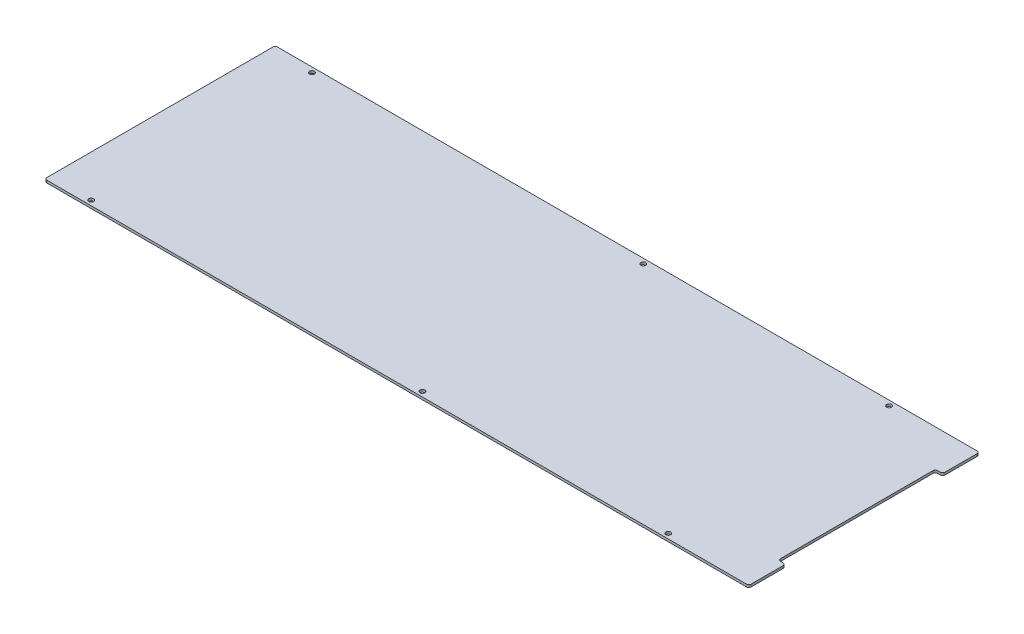
ISO-10303-21;
HEADER;
FILE_DESCRIPTION(('STEP AP214'),'2;1');
FILE_NAME('part.step','',(''),(''),'','','');
FILE_SCHEMA(('AUTOMOTIVE_DESIGN { 1 0 10303 214 1 1 1 1 }'));
ENDSEC;
DATA;
#1=APPLICATION_CONTEXT('core data for automotive mechanical design processes');
#2=APPLICATION_PROTOCOL_DEFINITION('international standard','automotive_design',2000,#1);
#3=PRODUCT_CONTEXT('',#1,'mechanical');
#4=PRODUCT('Part','Part','',(#3));
#5=PRODUCT_RELATED_PRODUCT_CATEGORY('part','',(#4));
#6=PRODUCT_DEFINITION_FORMATION('','',#4);
#7=PRODUCT_DEFINITION_CONTEXT('part definition',#1,'design');
#8=PRODUCT_DEFINITION('design','',#6,#7);
#9=PRODUCT_DEFINITION_SHAPE('','',#8);
#10=(LENGTH_UNIT() NAMED_UNIT(*) SI_UNIT(.MILLI.,.METRE.));
#11=(NAMED_UNIT(*) PLANE_ANGLE_UNIT() SI_UNIT($,.RADIAN.));
#12=(NAMED_UNIT(*) SI_UNIT($,.STERADIAN.) SOLID_ANGLE_UNIT());
#13=UNCERTAINTY_MEASURE_WITH_UNIT(LENGTH_MEASURE(1.E-05),#10,'distance_accuracy_value','');
#14=(GEOMETRIC_REPRESENTATION_CONTEXT(3) GLOBAL_UNCERTAINTY_ASSIGNED_CONTEXT((#13)) GLOBAL_UNIT_ASSIGNED_CONTEXT((#10,
#11,#12)) REPRESENTATION_CONTEXT('',''));
#15=CARTESIAN_POINT('',(0.,0.,0.));
#16=DIRECTION('',(0.,0.,1.));
#17=DIRECTION('',(1.,0.,0.));
#18=AXIS2_PLACEMENT_3D('',#15,#16,#17);
#19=CARTESIAN_POINT('',(455.6125,3.175,149.225));
#20=DIRECTION('',(-1.,0.,0.));
#21=DIRECTION('',(0.,0.,1.));
#22=AXIS2_PLACEMENT_3D('',#19,#20,#21);
#23=PLANE('',#22);
#24=DIRECTION('',(0.,0.,-1.));
#25=VECTOR('',#24,1.);
#26=CARTESIAN_POINT('',(455.6125,3.175,149.225));
#27=LINE('',#26,#25);
#28=CARTESIAN_POINT('',(455.6125,3.175,146.05));
#29=VERTEX_POINT('',#28);
#30=CARTESIAN_POINT('',(455.6125,3.175,104.775));
#31=VERTEX_POINT('',#30);
#32=EDGE_CURVE('E233',#29,#31,#27,.T.);
#33=ORIENTED_EDGE('',*,*,#32,.F.);
#34=DIRECTION('',(0.,-1.,0.));
#35=VECTOR('',#34,1.);
#36=CARTESIAN_POINT('',(455.6125,3.175,146.05));
#37=LINE('',#36,#35);
#38=CARTESIAN_POINT('',(455.6125,0.,146.05));
#39=VERTEX_POINT('',#38);
#40=EDGE_CURVE('E333',#29,#39,#37,.T.);
#41=ORIENTED_EDGE('',*,*,#40,.T.);
#42=DIRECTION('',(0.,0.,-1.));
#43=VECTOR('',#42,1.);
#44=CARTESIAN_POINT('',(455.6125,0.,149.225));
#45=LINE('',#44,#43);
#46=CARTESIAN_POINT('',(455.6125,0.,104.775));
#47=VERTEX_POINT('',#46);
#48=EDGE_CURVE('E248',#39,#47,#45,.T.);
#49=ORIENTED_EDGE('',*,*,#48,.T.);
#50=DIRECTION('',(0.,1.,0.));
#51=VECTOR('',#50,1.);
#52=CARTESIAN_POINT('',(455.6125,3.175,104.775));
#53=LINE('',#52,#51);
#54=EDGE_CURVE('E329',#47,#31,#53,.T.);
#55=ORIENTED_EDGE('',*,*,#54,.T.);
#56=EDGE_LOOP('',(#33,#41,#49,#55));
#57=FACE_BOUND('',#56,.T.);
#58=ADVANCED_FACE('F60',(#57),#23,.F.);
#59=CARTESIAN_POINT('',(455.6125,3.175,-104.775));
#60=VERTEX_POINT('',#59);
#61=CARTESIAN_POINT('',(455.6125,3.175,-146.05));
#62=VERTEX_POINT('',#61);
#63=EDGE_CURVE('E230',#60,#62,#27,.T.);
#64=ORIENTED_EDGE('',*,*,#63,.F.);
#65=DIRECTION('',(0.,1.,0.));
#66=VECTOR('',#65,1.);
#67=CARTESIAN_POINT('',(455.6125,3.175,-104.775));
#68=LINE('',#67,#66);
#69=CARTESIAN_POINT('',(455.6125,0.,-104.775));
#70=VERTEX_POINT('',#69);
#71=EDGE_CURVE('E12',#60,#70,#68,.F.);
#72=ORIENTED_EDGE('',*,*,#71,.T.);
#73=CARTESIAN_POINT('',(455.6125,0.,-146.05));
#74=VERTEX_POINT('',#73);
#75=EDGE_CURVE('E244',#70,#74,#45,.T.);
#76=ORIENTED_EDGE('',*,*,#75,.T.);
#77=DIRECTION('',(0.,-1.,0.));
#78=VECTOR('',#77,1.);
#79=CARTESIAN_POINT('',(455.6125,3.175,-146.05));
#80=LINE('',#79,#78);
#81=EDGE_CURVE('E69',#74,#62,#80,.F.);
#82=ORIENTED_EDGE('',*,*,#81,.T.);
#83=EDGE_LOOP('',(#64,#72,#76,#82));
#84=FACE_BOUND('',#83,.T.);
#85=ADVANCED_FACE('F348',(#84),#23,.F.);
#86=CARTESIAN_POINT('',(-455.6125,3.175,-149.225));
#87=DIRECTION('',(0.,0.,1.));
#88=DIRECTION('',(1.,0.,0.));
#89=AXIS2_PLACEMENT_3D('',#86,#87,#88);
#90=PLANE('',#89);
#91=DIRECTION('',(-1.,0.,0.));
#92=VECTOR('',#91,1.);
#93=CARTESIAN_POINT('',(-455.6125,0.,-149.225));
#94=LINE('',#93,#92);
#95=CARTESIAN_POINT('',(452.4375,0.,-149.225));
#96=VERTEX_POINT('',#95);
#97=CARTESIAN_POINT('',(-452.4375,0.,-149.225));
#98=VERTEX_POINT('',#97);
#99=EDGE_CURVE('E249',#96,#98,#94,.T.);
#100=ORIENTED_EDGE('',*,*,#99,.T.);
#101=DIRECTION('',(0.,-1.,0.));
#102=VECTOR('',#101,1.);
#103=CARTESIAN_POINT('',(-452.4375,3.175,-149.225));
#104=LINE('',#103,#102);
#105=CARTESIAN_POINT('',(-452.4375,3.175,-149.225));
#106=VERTEX_POINT('',#105);
#107=EDGE_CURVE('E76',#98,#106,#104,.F.);
#108=ORIENTED_EDGE('',*,*,#107,.T.);
#109=DIRECTION('',(-1.,0.,0.));
#110=VECTOR('',#109,1.);
#111=CARTESIAN_POINT('',(-455.6125,3.175,-149.225));
#112=LINE('',#111,#110);
#113=CARTESIAN_POINT('',(452.4375,3.175,-149.225));
#114=VERTEX_POINT('',#113);
#115=EDGE_CURVE('E235',#114,#106,#112,.T.);
#116=ORIENTED_EDGE('',*,*,#115,.F.);
#117=DIRECTION('',(0.,-1.,0.));
#118=VECTOR('',#117,1.);
#119=CARTESIAN_POINT('',(452.4375,3.175,-149.225));
#120=LINE('',#119,#118);
#121=EDGE_CURVE('E323',#114,#96,#120,.T.);
#122=ORIENTED_EDGE('',*,*,#121,.T.);
#123=EDGE_LOOP('',(#100,#108,#116,#122));
#124=FACE_BOUND('',#123,.T.);
#125=ADVANCED_FACE('F355',(#124),#90,.F.);
#126=CARTESIAN_POINT('',(-455.6125,3.175,149.225));
#127=DIRECTION('',(1.,0.,0.));
#128=DIRECTION('',(0.,0.,-1.));
#129=AXIS2_PLACEMENT_3D('',#126,#127,#128);
#130=PLANE('',#129);
#131=DIRECTION('',(0.,0.,1.));
#132=VECTOR('',#131,1.);
#133=CARTESIAN_POINT('',(-455.6125,0.,149.225));
#134=LINE('',#133,#132);
#135=CARTESIAN_POINT('',(-455.6125,0.,-146.05));
#136=VERTEX_POINT('',#135);
#137=CARTESIAN_POINT('',(-455.6125,0.,146.05));
#138=VERTEX_POINT('',#137);
#139=EDGE_CURVE('E252',#136,#138,#134,.T.);
#140=ORIENTED_EDGE('',*,*,#139,.T.);
#141=DIRECTION('',(0.,-1.,0.));
#142=VECTOR('',#141,1.);
#143=CARTESIAN_POINT('',(-455.6125,3.175,146.05));
#144=LINE('',#143,#142);
#145=CARTESIAN_POINT('',(-455.6125,3.175,146.05));
#146=VERTEX_POINT('',#145);
#147=EDGE_CURVE('E304',#138,#146,#144,.F.);
#148=ORIENTED_EDGE('',*,*,#147,.T.);
#149=DIRECTION('',(0.,0.,1.));
#150=VECTOR('',#149,1.);
#151=CARTESIAN_POINT('',(-455.6125,3.175,149.225));
#152=LINE('',#151,#150);
#153=CARTESIAN_POINT('',(-455.6125,3.175,-146.05));
#154=VERTEX_POINT('',#153);
#155=EDGE_CURVE('E238',#154,#146,#152,.T.);
#156=ORIENTED_EDGE('',*,*,#155,.F.);
#157=DIRECTION('',(0.,-1.,0.));
#158=VECTOR('',#157,1.);
#159=CARTESIAN_POINT('',(-455.6125,3.175,-146.05));
#160=LINE('',#159,#158);
#161=EDGE_CURVE('E300',#154,#136,#160,.T.);
#162=ORIENTED_EDGE('',*,*,#161,.T.);
#163=EDGE_LOOP('',(#140,#148,#156,#162));
#164=FACE_BOUND('',#163,.T.);
#165=ADVANCED_FACE('F366',(#164),#130,.F.);
#166=CARTESIAN_POINT('',(-455.6125,3.175,149.225));
#167=DIRECTION('',(0.,0.,-1.));
#168=DIRECTION('',(-1.,0.,0.));
#169=AXIS2_PLACEMENT_3D('',#166,#167,#168);
#170=PLANE('',#169);
#171=DIRECTION('',(1.,0.,0.));
#172=VECTOR('',#171,1.);
#173=CARTESIAN_POINT('',(-455.6125,3.175,149.225));
#174=LINE('',#173,#172);
#175=CARTESIAN_POINT('',(-452.4375,3.175,149.225));
#176=VERTEX_POINT('',#175);
#177=CARTESIAN_POINT('',(452.4375,3.175,149.225));
#178=VERTEX_POINT('',#177);
#179=EDGE_CURVE('E210',#176,#178,#174,.T.);
#180=ORIENTED_EDGE('',*,*,#179,.F.);
#181=DIRECTION('',(0.,-1.,0.));
#182=VECTOR('',#181,1.);
#183=CARTESIAN_POINT('',(-452.4375,3.175,149.225));
#184=LINE('',#183,#182);
#185=CARTESIAN_POINT('',(-452.4375,0.,149.225));
#186=VERTEX_POINT('',#185);
#187=EDGE_CURVE('E278',#176,#186,#184,.T.);
#188=ORIENTED_EDGE('',*,*,#187,.T.);
#189=DIRECTION('',(1.,0.,0.));
#190=VECTOR('',#189,1.);
#191=CARTESIAN_POINT('',(-455.6125,0.,149.225));
#192=LINE('',#191,#190);
#193=CARTESIAN_POINT('',(452.4375,0.,149.225));
#194=VERTEX_POINT('',#193);
#195=EDGE_CURVE('E234',#186,#194,#192,.T.);
#196=ORIENTED_EDGE('',*,*,#195,.T.);
#197=DIRECTION('',(0.,-1.,0.));
#198=VECTOR('',#197,1.);
#199=CARTESIAN_POINT('',(452.4375,3.175,149.225));
#200=LINE('',#199,#198);
#201=EDGE_CURVE('E275',#194,#178,#200,.F.);
#202=ORIENTED_EDGE('',*,*,#201,.T.);
#203=EDGE_LOOP('',(#180,#188,#196,#202));
#204=FACE_BOUND('',#203,.T.);
#205=ADVANCED_FACE('F374',(#204),#170,.F.);
#206=CARTESIAN_POINT('',(0.,3.175,0.));
#207=DIRECTION('',(0.,-1.,0.));
#208=DIRECTION('',(0.,0.,-1.));
#209=AXIS2_PLACEMENT_3D('',#206,#207,#208);
#210=PLANE('',#209);
#211=CARTESIAN_POINT('',(345.04884,3.175,142.875));
#212=DIRECTION('',(0.,-1.,0.));
#213=DIRECTION('',(0.,0.,-1.));
#214=AXIS2_PLACEMENT_3D('',#211,#212,#213);
#215=CIRCLE('',#214,3.17499999999998);
#216=CARTESIAN_POINT('',(345.04884,3.175,139.7));
#217=VERTEX_POINT('',#216);
#218=EDGE_CURVE('E403',#217,#217,#215,.T.);
#219=ORIENTED_EDGE('',*,*,#218,.T.);
#220=EDGE_LOOP('',(#219));
#221=FACE_BOUND('',#220,.T.);
#222=CARTESIAN_POINT('',(-401.6375,3.175,142.875));
#223=DIRECTION('',(0.,-1.,0.));
#224=DIRECTION('',(0.,0.,-1.));
#225=AXIS2_PLACEMENT_3D('',#222,#223,#224);
#226=CIRCLE('',#225,3.17499999999998);
#227=CARTESIAN_POINT('',(-401.6375,3.175,139.7));
#228=VERTEX_POINT('',#227);
#229=EDGE_CURVE('E423',#228,#228,#226,.T.);
#230=ORIENTED_EDGE('',*,*,#229,.T.);
#231=EDGE_LOOP('',(#230));
#232=FACE_BOUND('',#231,.T.);
#233=CARTESIAN_POINT('',(26.9875000000001,3.175,142.875));
#234=DIRECTION('',(0.,-1.,0.));
#235=DIRECTION('',(0.,0.,-1.));
#236=AXIS2_PLACEMENT_3D('',#233,#234,#235);
#237=CIRCLE('',#236,3.175);
#238=CARTESIAN_POINT('',(26.9875000000001,3.175,139.7));
#239=VERTEX_POINT('',#238);
#240=EDGE_CURVE('E422',#239,#239,#237,.T.);
#241=ORIENTED_EDGE('',*,*,#240,.T.);
#242=EDGE_LOOP('',(#241));
#243=FACE_BOUND('',#242,.T.);
#244=CARTESIAN_POINT('',(345.04884,3.175,-142.875));
#245=DIRECTION('',(0.,-1.,0.));
#246=DIRECTION('',(0.,0.,-1.));
#247=AXIS2_PLACEMENT_3D('',#244,#245,#246);
#248=CIRCLE('',#247,3.17499999999998);
#249=CARTESIAN_POINT('',(345.04884,3.175,-146.05));
#250=VERTEX_POINT('',#249);
#251=EDGE_CURVE('E436',#250,#250,#248,.T.);
#252=ORIENTED_EDGE('',*,*,#251,.T.);
#253=EDGE_LOOP('',(#252));
#254=FACE_BOUND('',#253,.T.);
#255=CARTESIAN_POINT('',(-401.6375,3.175,-142.875));
#256=DIRECTION('',(0.,-1.,0.));
#257=DIRECTION('',(0.,0.,-1.));
#258=AXIS2_PLACEMENT_3D('',#255,#256,#257);
#259=CIRCLE('',#258,3.17499999999998);
#260=CARTESIAN_POINT('',(-401.6375,3.175,-146.05));
#261=VERTEX_POINT('',#260);
#262=EDGE_CURVE('E446',#261,#261,#259,.T.);
#263=ORIENTED_EDGE('',*,*,#262,.T.);
#264=EDGE_LOOP('',(#263));
#265=FACE_BOUND('',#264,.T.);
#266=CARTESIAN_POINT('',(26.9875000000001,3.175,-142.875));
#267=DIRECTION('',(0.,-1.,0.));
#268=DIRECTION('',(0.,0.,-1.));
#269=AXIS2_PLACEMENT_3D('',#266,#267,#268);
#270=CIRCLE('',#269,3.175);
#271=CARTESIAN_POINT('',(26.9875000000001,3.175,-146.05));
#272=VERTEX_POINT('',#271);
#273=EDGE_CURVE('E456',#272,#272,#270,.T.);
#274=ORIENTED_EDGE('',*,*,#273,.T.);
#275=EDGE_LOOP('',(#274));
#276=FACE_BOUND('',#275,.T.);
#277=ORIENTED_EDGE('',*,*,#155,.T.);
#278=CARTESIAN_POINT('',(-452.4375,3.175,146.05));
#279=DIRECTION('',(0.,-1.,0.));
#280=DIRECTION('',(0.,0.,-1.));
#281=AXIS2_PLACEMENT_3D('',#278,#279,#280);
#282=CIRCLE('',#281,3.175);
#283=EDGE_CURVE('E320',#146,#176,#282,.F.);
#284=ORIENTED_EDGE('',*,*,#283,.T.);
#285=ORIENTED_EDGE('',*,*,#179,.T.);
#286=CARTESIAN_POINT('',(452.4375,3.175,146.05));
#287=DIRECTION('',(0.,-1.,0.));
#288=DIRECTION('',(0.,0.,-1.));
#289=AXIS2_PLACEMENT_3D('',#286,#287,#288);
#290=CIRCLE('',#289,3.175);
#291=EDGE_CURVE('E314',#178,#29,#290,.F.);
#292=ORIENTED_EDGE('',*,*,#291,.T.);
#293=ORIENTED_EDGE('',*,*,#32,.T.);
#294=CARTESIAN_POINT('',(452.4375,3.175,104.775));
#295=DIRECTION('',(0.,-1.,0.));
#296=DIRECTION('',(0.,0.,-1.));
#297=AXIS2_PLACEMENT_3D('',#294,#295,#296);
#298=CIRCLE('',#297,3.175);
#299=CARTESIAN_POINT('',(452.4375,3.175,101.6));
#300=VERTEX_POINT('',#299);
#301=EDGE_CURVE('E215',#31,#300,#298,.F.);
#302=ORIENTED_EDGE('',*,*,#301,.T.);
#303=DIRECTION('',(1.,0.,0.));
#304=VECTOR('',#303,1.);
#305=CARTESIAN_POINT('',(455.6125,3.175,101.6));
#306=LINE('',#305,#304);
#307=CARTESIAN_POINT('',(449.2625,3.175,101.6));
#308=VERTEX_POINT('',#307);
#309=EDGE_CURVE('E204',#308,#300,#306,.T.);
#310=ORIENTED_EDGE('',*,*,#309,.F.);
#311=CARTESIAN_POINT('',(449.2625,3.175,98.425));
#312=DIRECTION('',(0.,-1.,0.));
#313=DIRECTION('',(0.,0.,-1.));
#314=AXIS2_PLACEMENT_3D('',#311,#312,#313);
#315=CIRCLE('',#314,3.175);
#316=CARTESIAN_POINT('',(446.0875,3.175,98.425));
#317=VERTEX_POINT('',#316);
#318=EDGE_CURVE('E187',#308,#317,#315,.T.);
#319=ORIENTED_EDGE('',*,*,#318,.T.);
#320=DIRECTION('',(0.,0.,1.));
#321=VECTOR('',#320,1.);
#322=CARTESIAN_POINT('',(446.0875,3.175,-101.6));
#323=LINE('',#322,#321);
#324=CARTESIAN_POINT('',(446.0875,3.175,-98.425));
#325=VERTEX_POINT('',#324);
#326=EDGE_CURVE('E218',#325,#317,#323,.T.);
#327=ORIENTED_EDGE('',*,*,#326,.F.);
#328=CARTESIAN_POINT('',(449.2625,3.175,-98.425));
#329=DIRECTION('',(0.,-1.,0.));
#330=DIRECTION('',(0.,0.,-1.));
#331=AXIS2_PLACEMENT_3D('',#328,#329,#330);
#332=CIRCLE('',#331,3.175);
#333=CARTESIAN_POINT('',(449.2625,3.175,-101.6));
#334=VERTEX_POINT('',#333);
#335=EDGE_CURVE('E268',#325,#334,#332,.T.);
#336=ORIENTED_EDGE('',*,*,#335,.T.);
#337=DIRECTION('',(-1.,0.,0.));
#338=VECTOR('',#337,1.);
#339=CARTESIAN_POINT('',(455.6125,3.175,-101.6));
#340=LINE('',#339,#338);
#341=CARTESIAN_POINT('',(452.4375,3.175,-101.6));
#342=VERTEX_POINT('',#341);
#343=EDGE_CURVE('E226',#342,#334,#340,.T.);
#344=ORIENTED_EDGE('',*,*,#343,.F.);
#345=CARTESIAN_POINT('',(452.4375,3.175,-104.775));
#346=DIRECTION('',(0.,-1.,0.));
#347=DIRECTION('',(0.,0.,-1.));
#348=AXIS2_PLACEMENT_3D('',#345,#346,#347);
#349=CIRCLE('',#348,3.175);
#350=EDGE_CURVE('E309',#342,#60,#349,.F.);
#351=ORIENTED_EDGE('',*,*,#350,.T.);
#352=ORIENTED_EDGE('',*,*,#63,.T.);
#353=CARTESIAN_POINT('',(452.4375,3.175,-146.05));
#354=DIRECTION('',(0.,-1.,0.));
#355=DIRECTION('',(0.,0.,-1.));
#356=AXIS2_PLACEMENT_3D('',#353,#354,#355);
#357=CIRCLE('',#356,3.175);
#358=EDGE_CURVE('E83',#62,#114,#357,.F.);
#359=ORIENTED_EDGE('',*,*,#358,.T.);
#360=ORIENTED_EDGE('',*,*,#115,.T.);
#361=CARTESIAN_POINT('',(-452.4375,3.175,-146.05));
#362=DIRECTION('',(0.,-1.,0.));
#363=DIRECTION('',(0.,0.,-1.));
#364=AXIS2_PLACEMENT_3D('',#361,#362,#363);
#365=CIRCLE('',#364,3.175);
#366=EDGE_CURVE('E317',#106,#154,#365,.F.);
#367=ORIENTED_EDGE('',*,*,#366,.T.);
#368=EDGE_LOOP('',(#277,#284,#285,#292,#293,#302,#310,#319,#327,#336,#344,#351,#352,#359,#360,#367));
#369=FACE_BOUND('',#368,.T.);
#370=ADVANCED_FACE('F213',(#221,#232,#243,#254,#265,#276,#369),#210,.F.);
#371=CARTESIAN_POINT('',(0.,0.,0.));
#372=DIRECTION('',(0.,-1.,0.));
#373=DIRECTION('',(0.,0.,-1.));
#374=AXIS2_PLACEMENT_3D('',#371,#372,#373);
#375=PLANE('',#374);
#376=CARTESIAN_POINT('',(345.04884,0.,142.875));
#377=DIRECTION('',(0.,-1.,0.));
#378=DIRECTION('',(0.,0.,-1.));
#379=AXIS2_PLACEMENT_3D('',#376,#377,#378);
#380=CIRCLE('',#379,3.17499999999998);
#381=CARTESIAN_POINT('',(345.04884,0.,139.7));
#382=VERTEX_POINT('',#381);
#383=EDGE_CURVE('E399',#382,#382,#380,.T.);
#384=ORIENTED_EDGE('',*,*,#383,.F.);
#385=EDGE_LOOP('',(#384));
#386=FACE_BOUND('',#385,.T.);
#387=CARTESIAN_POINT('',(-401.6375,0.,142.875));
#388=DIRECTION('',(0.,-1.,0.));
#389=DIRECTION('',(0.,0.,-1.));
#390=AXIS2_PLACEMENT_3D('',#387,#388,#389);
#391=CIRCLE('',#390,3.17499999999998);
#392=CARTESIAN_POINT('',(-401.6375,0.,139.7));
#393=VERTEX_POINT('',#392);
#394=EDGE_CURVE('E408',#393,#393,#391,.T.);
#395=ORIENTED_EDGE('',*,*,#394,.F.);
#396=EDGE_LOOP('',(#395));
#397=FACE_BOUND('',#396,.T.);
#398=CARTESIAN_POINT('',(26.9875000000001,0.,142.875));
#399=DIRECTION('',(0.,-1.,0.));
#400=DIRECTION('',(0.,0.,-1.));
#401=AXIS2_PLACEMENT_3D('',#398,#399,#400);
#402=CIRCLE('',#401,3.17499999999999);
#403=CARTESIAN_POINT('',(26.9875000000001,0.,139.7));
#404=VERTEX_POINT('',#403);
#405=EDGE_CURVE('E418',#404,#404,#402,.T.);
#406=ORIENTED_EDGE('',*,*,#405,.F.);
#407=EDGE_LOOP('',(#406));
#408=FACE_BOUND('',#407,.T.);
#409=CARTESIAN_POINT('',(345.04884,0.,-142.875));
#410=DIRECTION('',(0.,-1.,0.));
#411=DIRECTION('',(0.,0.,-1.));
#412=AXIS2_PLACEMENT_3D('',#409,#410,#411);
#413=CIRCLE('',#412,3.17499999999998);
#414=CARTESIAN_POINT('',(345.04884,0.,-146.05));
#415=VERTEX_POINT('',#414);
#416=EDGE_CURVE('E429',#415,#415,#413,.T.);
#417=ORIENTED_EDGE('',*,*,#416,.F.);
#418=EDGE_LOOP('',(#417));
#419=FACE_BOUND('',#418,.T.);
#420=CARTESIAN_POINT('',(-401.6375,0.,-142.875));
#421=DIRECTION('',(0.,-1.,0.));
#422=DIRECTION('',(0.,0.,-1.));
#423=AXIS2_PLACEMENT_3D('',#420,#421,#422);
#424=CIRCLE('',#423,3.17499999999998);
#425=CARTESIAN_POINT('',(-401.6375,0.,-146.05));
#426=VERTEX_POINT('',#425);
#427=EDGE_CURVE('E441',#426,#426,#424,.T.);
#428=ORIENTED_EDGE('',*,*,#427,.F.);
#429=EDGE_LOOP('',(#428));
#430=FACE_BOUND('',#429,.T.);
#431=CARTESIAN_POINT('',(26.9875000000001,0.,-142.875));
#432=DIRECTION('',(0.,-1.,0.));
#433=DIRECTION('',(0.,0.,-1.));
#434=AXIS2_PLACEMENT_3D('',#431,#432,#433);
#435=CIRCLE('',#434,3.17499999999999);
#436=CARTESIAN_POINT('',(26.9875000000001,0.,-146.05));
#437=VERTEX_POINT('',#436);
#438=EDGE_CURVE('E451',#437,#437,#435,.T.);
#439=ORIENTED_EDGE('',*,*,#438,.F.);
#440=EDGE_LOOP('',(#439));
#441=FACE_BOUND('',#440,.T.);
#442=ORIENTED_EDGE('',*,*,#195,.F.);
#443=CARTESIAN_POINT('',(-452.4375,0.,146.05));
#444=DIRECTION('',(0.,-1.,0.));
#445=DIRECTION('',(0.,0.,-1.));
#446=AXIS2_PLACEMENT_3D('',#443,#444,#445);
#447=CIRCLE('',#446,3.175);
#448=EDGE_CURVE('E297',#186,#138,#447,.T.);
#449=ORIENTED_EDGE('',*,*,#448,.T.);
#450=ORIENTED_EDGE('',*,*,#139,.F.);
#451=CARTESIAN_POINT('',(-452.4375,0.,-146.05));
#452=DIRECTION('',(0.,-1.,0.));
#453=DIRECTION('',(0.,0.,-1.));
#454=AXIS2_PLACEMENT_3D('',#451,#452,#453);
#455=CIRCLE('',#454,3.175);
#456=EDGE_CURVE('E294',#136,#98,#455,.T.);
#457=ORIENTED_EDGE('',*,*,#456,.T.);
#458=ORIENTED_EDGE('',*,*,#99,.F.);
#459=CARTESIAN_POINT('',(452.4375,0.,-146.05));
#460=DIRECTION('',(0.,-1.,0.));
#461=DIRECTION('',(0.,0.,-1.));
#462=AXIS2_PLACEMENT_3D('',#459,#460,#461);
#463=CIRCLE('',#462,3.175);
#464=EDGE_CURVE('E282',#96,#74,#463,.T.);
#465=ORIENTED_EDGE('',*,*,#464,.T.);
#466=ORIENTED_EDGE('',*,*,#75,.F.);
#467=CARTESIAN_POINT('',(452.4375,0.,-104.775));
#468=DIRECTION('',(0.,-1.,0.));
#469=DIRECTION('',(0.,0.,-1.));
#470=AXIS2_PLACEMENT_3D('',#467,#468,#469);
#471=CIRCLE('',#470,3.175);
#472=CARTESIAN_POINT('',(452.4375,0.,-101.6));
#473=VERTEX_POINT('',#472);
#474=EDGE_CURVE('E285',#70,#473,#471,.T.);
#475=ORIENTED_EDGE('',*,*,#474,.T.);
#476=DIRECTION('',(-1.,0.,0.));
#477=VECTOR('',#476,1.);
#478=CARTESIAN_POINT('',(455.6125,0.,-101.6));
#479=LINE('',#478,#477);
#480=CARTESIAN_POINT('',(449.2625,0.,-101.6));
#481=VERTEX_POINT('',#480);
#482=EDGE_CURVE('E217',#473,#481,#479,.T.);
#483=ORIENTED_EDGE('',*,*,#482,.T.);
#484=CARTESIAN_POINT('',(449.2625,0.,-98.425));
#485=DIRECTION('',(0.,-1.,0.));
#486=DIRECTION('',(0.,0.,-1.));
#487=AXIS2_PLACEMENT_3D('',#484,#485,#486);
#488=CIRCLE('',#487,3.175);
#489=CARTESIAN_POINT('',(446.0875,0.,-98.425));
#490=VERTEX_POINT('',#489);
#491=EDGE_CURVE('E272',#481,#490,#488,.F.);
#492=ORIENTED_EDGE('',*,*,#491,.T.);
#493=DIRECTION('',(0.,0.,1.));
#494=VECTOR('',#493,1.);
#495=CARTESIAN_POINT('',(446.0875,0.,-101.6));
#496=LINE('',#495,#494);
#497=CARTESIAN_POINT('',(446.0875,0.,98.425));
#498=VERTEX_POINT('',#497);
#499=EDGE_CURVE('E224',#490,#498,#496,.T.);
#500=ORIENTED_EDGE('',*,*,#499,.T.);
#501=CARTESIAN_POINT('',(449.2625,0.,98.425));
#502=DIRECTION('',(0.,-1.,0.));
#503=DIRECTION('',(0.,0.,-1.));
#504=AXIS2_PLACEMENT_3D('',#501,#502,#503);
#505=CIRCLE('',#504,3.175);
#506=CARTESIAN_POINT('',(449.2625,0.,101.6));
#507=VERTEX_POINT('',#506);
#508=EDGE_CURVE('E197',#498,#507,#505,.F.);
#509=ORIENTED_EDGE('',*,*,#508,.T.);
#510=DIRECTION('',(1.,0.,0.));
#511=VECTOR('',#510,1.);
#512=CARTESIAN_POINT('',(455.6125,0.,101.6));
#513=LINE('',#512,#511);
#514=CARTESIAN_POINT('',(452.4375,0.,101.6));
#515=VERTEX_POINT('',#514);
#516=EDGE_CURVE('E207',#507,#515,#513,.T.);
#517=ORIENTED_EDGE('',*,*,#516,.T.);
#518=CARTESIAN_POINT('',(452.4375,0.,104.775));
#519=DIRECTION('',(0.,-1.,0.));
#520=DIRECTION('',(0.,0.,-1.));
#521=AXIS2_PLACEMENT_3D('',#518,#519,#520);
#522=CIRCLE('',#521,3.175);
#523=EDGE_CURVE('E288',#515,#47,#522,.T.);
#524=ORIENTED_EDGE('',*,*,#523,.T.);
#525=ORIENTED_EDGE('',*,*,#48,.F.);
#526=CARTESIAN_POINT('',(452.4375,0.,146.05));
#527=DIRECTION('',(0.,-1.,0.));
#528=DIRECTION('',(0.,0.,-1.));
#529=AXIS2_PLACEMENT_3D('',#526,#527,#528);
#530=CIRCLE('',#529,3.175);
#531=EDGE_CURVE('E291',#39,#194,#530,.T.);
#532=ORIENTED_EDGE('',*,*,#531,.T.);
#533=EDGE_LOOP('',(#442,#449,#450,#457,#458,#465,#466,#475,#483,#492,#500,#509,#517,#524,#525,#532));
#534=FACE_BOUND('',#533,.T.);
#535=ADVANCED_FACE('F358',(#386,#397,#408,#419,#430,#441,#534),#375,.T.);
#536=CARTESIAN_POINT('',(455.6125,0.,101.6));
#537=DIRECTION('',(0.,0.,1.));
#538=DIRECTION('',(1.,0.,0.));
#539=AXIS2_PLACEMENT_3D('',#536,#537,#538);
#540=PLANE('',#539);
#541=ORIENTED_EDGE('',*,*,#309,.T.);
#542=DIRECTION('',(0.,1.,0.));
#543=VECTOR('',#542,1.);
#544=CARTESIAN_POINT('',(452.4375,0.,101.6));
#545=LINE('',#544,#543);
#546=EDGE_CURVE('E337',#300,#515,#545,.F.);
#547=ORIENTED_EDGE('',*,*,#546,.T.);
#548=ORIENTED_EDGE('',*,*,#516,.F.);
#549=DIRECTION('',(0.,1.,0.));
#550=VECTOR('',#549,1.);
#551=CARTESIAN_POINT('',(449.2625,3.175,101.6));
#552=LINE('',#551,#550);
#553=EDGE_CURVE('E191',#507,#308,#552,.T.);
#554=ORIENTED_EDGE('',*,*,#553,.T.);
#555=EDGE_LOOP('',(#541,#547,#548,#554));
#556=FACE_BOUND('',#555,.T.);
#557=ADVANCED_FACE('F203',(#556),#540,.F.);
#558=CARTESIAN_POINT('',(446.0875,0.,-101.6));
#559=DIRECTION('',(-1.,0.,0.));
#560=DIRECTION('',(0.,0.,1.));
#561=AXIS2_PLACEMENT_3D('',#558,#559,#560);
#562=PLANE('',#561);
#563=ORIENTED_EDGE('',*,*,#326,.T.);
#564=DIRECTION('',(0.,1.,0.));
#565=VECTOR('',#564,1.);
#566=CARTESIAN_POINT('',(446.0875,0.,98.425));
#567=LINE('',#566,#565);
#568=EDGE_CURVE('E192',#317,#498,#567,.F.);
#569=ORIENTED_EDGE('',*,*,#568,.T.);
#570=ORIENTED_EDGE('',*,*,#499,.F.);
#571=DIRECTION('',(0.,1.,0.));
#572=VECTOR('',#571,1.);
#573=CARTESIAN_POINT('',(446.0875,3.175,-98.425));
#574=LINE('',#573,#572);
#575=EDGE_CURVE('E209',#490,#325,#574,.T.);
#576=ORIENTED_EDGE('',*,*,#575,.T.);
#577=EDGE_LOOP('',(#563,#569,#570,#576));
#578=FACE_BOUND('',#577,.T.);
#579=ADVANCED_FACE('F588',(#578),#562,.F.);
#580=CARTESIAN_POINT('',(455.6125,0.,-101.6));
#581=DIRECTION('',(0.,0.,-1.));
#582=DIRECTION('',(-1.,0.,0.));
#583=AXIS2_PLACEMENT_3D('',#580,#581,#582);
#584=PLANE('',#583);
#585=ORIENTED_EDGE('',*,*,#482,.F.);
#586=DIRECTION('',(0.,1.,0.));
#587=VECTOR('',#586,1.);
#588=CARTESIAN_POINT('',(452.4375,0.,-101.6));
#589=LINE('',#588,#587);
#590=EDGE_CURVE('E340',#473,#342,#589,.T.);
#591=ORIENTED_EDGE('',*,*,#590,.T.);
#592=ORIENTED_EDGE('',*,*,#343,.T.);
#593=DIRECTION('',(0.,1.,0.));
#594=VECTOR('',#593,1.);
#595=CARTESIAN_POINT('',(449.2625,0.,-101.6));
#596=LINE('',#595,#594);
#597=EDGE_CURVE('E198',#334,#481,#596,.F.);
#598=ORIENTED_EDGE('',*,*,#597,.T.);
#599=EDGE_LOOP('',(#585,#591,#592,#598));
#600=FACE_BOUND('',#599,.T.);
#601=ADVANCED_FACE('F561',(#600),#584,.F.);
#602=CARTESIAN_POINT('',(449.2625,0.,98.425));
#603=DIRECTION('',(0.,-1.,0.));
#604=DIRECTION('',(0.,0.,-1.));
#605=AXIS2_PLACEMENT_3D('',#602,#603,#604);
#606=CYLINDRICAL_SURFACE('',#605,3.175);
#607=ORIENTED_EDGE('',*,*,#508,.F.);
#608=ORIENTED_EDGE('',*,*,#568,.F.);
#609=ORIENTED_EDGE('',*,*,#318,.F.);
#610=ORIENTED_EDGE('',*,*,#553,.F.);
#611=EDGE_LOOP('',(#607,#608,#609,#610));
#612=FACE_BOUND('',#611,.T.);
#613=ADVANCED_FACE('F190',(#612),#606,.F.);
#614=CARTESIAN_POINT('',(449.2625,0.,-98.425));
#615=DIRECTION('',(0.,-1.,0.));
#616=DIRECTION('',(0.,0.,-1.));
#617=AXIS2_PLACEMENT_3D('',#614,#615,#616);
#618=CYLINDRICAL_SURFACE('',#617,3.175);
#619=ORIENTED_EDGE('',*,*,#491,.F.);
#620=ORIENTED_EDGE('',*,*,#597,.F.);
#621=ORIENTED_EDGE('',*,*,#335,.F.);
#622=ORIENTED_EDGE('',*,*,#575,.F.);
#623=EDGE_LOOP('',(#619,#620,#621,#622));
#624=FACE_BOUND('',#623,.T.);
#625=ADVANCED_FACE('F538',(#624),#618,.F.);
#626=CARTESIAN_POINT('',(26.9875000000001,0.,-142.875));
#627=DIRECTION('',(0.,-1.,0.));
#628=DIRECTION('',(0.,0.,-1.));
#629=AXIS2_PLACEMENT_3D('',#626,#627,#628);
#630=CYLINDRICAL_SURFACE('',#629,3.17499999999999);
#631=ORIENTED_EDGE('',*,*,#273,.F.);
#632=EDGE_LOOP('',(#631));
#633=FACE_BOUND('',#632,.T.);
#634=ORIENTED_EDGE('',*,*,#438,.T.);
#635=EDGE_LOOP('',(#634));
#636=FACE_BOUND('',#635,.T.);
#637=ADVANCED_FACE('F535',(#633,#636),#630,.F.);
#638=CARTESIAN_POINT('',(-401.6375,0.,-142.875));
#639=DIRECTION('',(0.,-1.,0.));
#640=DIRECTION('',(0.,0.,-1.));
#641=AXIS2_PLACEMENT_3D('',#638,#639,#640);
#642=CYLINDRICAL_SURFACE('',#641,3.17499999999998);
#643=ORIENTED_EDGE('',*,*,#262,.F.);
#644=EDGE_LOOP('',(#643));
#645=FACE_BOUND('',#644,.T.);
#646=ORIENTED_EDGE('',*,*,#427,.T.);
#647=EDGE_LOOP('',(#646));
#648=FACE_BOUND('',#647,.T.);
#649=ADVANCED_FACE('F537',(#645,#648),#642,.F.);
#650=CARTESIAN_POINT('',(345.04884,0.,-142.875));
#651=DIRECTION('',(0.,-1.,0.));
#652=DIRECTION('',(0.,0.,-1.));
#653=AXIS2_PLACEMENT_3D('',#650,#651,#652);
#654=CYLINDRICAL_SURFACE('',#653,3.17499999999998);
#655=ORIENTED_EDGE('',*,*,#251,.F.);
#656=EDGE_LOOP('',(#655));
#657=FACE_BOUND('',#656,.T.);
#658=ORIENTED_EDGE('',*,*,#416,.T.);
#659=EDGE_LOOP('',(#658));
#660=FACE_BOUND('',#659,.T.);
#661=ADVANCED_FACE('F545',(#657,#660),#654,.F.);
#662=CARTESIAN_POINT('',(26.9875000000001,0.,142.875));
#663=DIRECTION('',(0.,-1.,0.));
#664=DIRECTION('',(0.,0.,-1.));
#665=AXIS2_PLACEMENT_3D('',#662,#663,#664);
#666=CYLINDRICAL_SURFACE('',#665,3.17499999999999);
#667=ORIENTED_EDGE('',*,*,#240,.F.);
#668=EDGE_LOOP('',(#667));
#669=FACE_BOUND('',#668,.T.);
#670=ORIENTED_EDGE('',*,*,#405,.T.);
#671=EDGE_LOOP('',(#670));
#672=FACE_BOUND('',#671,.T.);
#673=ADVANCED_FACE('F641',(#669,#672),#666,.F.);
#674=CARTESIAN_POINT('',(-401.6375,0.,142.875));
#675=DIRECTION('',(0.,-1.,0.));
#676=DIRECTION('',(0.,0.,-1.));
#677=AXIS2_PLACEMENT_3D('',#674,#675,#676);
#678=CYLINDRICAL_SURFACE('',#677,3.17499999999998);
#679=ORIENTED_EDGE('',*,*,#229,.F.);
#680=EDGE_LOOP('',(#679));
#681=FACE_BOUND('',#680,.T.);
#682=ORIENTED_EDGE('',*,*,#394,.T.);
#683=EDGE_LOOP('',(#682));
#684=FACE_BOUND('',#683,.T.);
#685=ADVANCED_FACE('F521',(#681,#684),#678,.F.);
#686=CARTESIAN_POINT('',(345.04884,0.,142.875));
#687=DIRECTION('',(0.,-1.,0.));
#688=DIRECTION('',(0.,0.,-1.));
#689=AXIS2_PLACEMENT_3D('',#686,#687,#688);
#690=CYLINDRICAL_SURFACE('',#689,3.17499999999998);
#691=ORIENTED_EDGE('',*,*,#218,.F.);
#692=EDGE_LOOP('',(#691));
#693=FACE_BOUND('',#692,.T.);
#694=ORIENTED_EDGE('',*,*,#383,.T.);
#695=EDGE_LOOP('',(#694));
#696=FACE_BOUND('',#695,.T.);
#697=ADVANCED_FACE('F565',(#693,#696),#690,.F.);
#698=CARTESIAN_POINT('',(-452.4375,3.175,146.05));
#699=DIRECTION('',(0.,-1.,0.));
#700=DIRECTION('',(0.,0.,-1.));
#701=AXIS2_PLACEMENT_3D('',#698,#699,#700);
#702=CYLINDRICAL_SURFACE('',#701,3.175);
#703=ORIENTED_EDGE('',*,*,#283,.F.);
#704=ORIENTED_EDGE('',*,*,#147,.F.);
#705=ORIENTED_EDGE('',*,*,#448,.F.);
#706=ORIENTED_EDGE('',*,*,#187,.F.);
#707=EDGE_LOOP('',(#703,#704,#705,#706));
#708=FACE_BOUND('',#707,.T.);
#709=ADVANCED_FACE('F372',(#708),#702,.T.);
#710=CARTESIAN_POINT('',(-452.4375,3.175,-146.05));
#711=DIRECTION('',(0.,-1.,0.));
#712=DIRECTION('',(0.,0.,-1.));
#713=AXIS2_PLACEMENT_3D('',#710,#711,#712);
#714=CYLINDRICAL_SURFACE('',#713,3.175);
#715=ORIENTED_EDGE('',*,*,#366,.F.);
#716=ORIENTED_EDGE('',*,*,#107,.F.);
#717=ORIENTED_EDGE('',*,*,#456,.F.);
#718=ORIENTED_EDGE('',*,*,#161,.F.);
#719=EDGE_LOOP('',(#715,#716,#717,#718));
#720=FACE_BOUND('',#719,.T.);
#721=ADVANCED_FACE('F363',(#720),#714,.T.);
#722=CARTESIAN_POINT('',(452.4375,3.175,146.05));
#723=DIRECTION('',(0.,-1.,0.));
#724=DIRECTION('',(0.,0.,-1.));
#725=AXIS2_PLACEMENT_3D('',#722,#723,#724);
#726=CYLINDRICAL_SURFACE('',#725,3.175);
#727=ORIENTED_EDGE('',*,*,#291,.F.);
#728=ORIENTED_EDGE('',*,*,#201,.F.);
#729=ORIENTED_EDGE('',*,*,#531,.F.);
#730=ORIENTED_EDGE('',*,*,#40,.F.);
#731=EDGE_LOOP('',(#727,#728,#729,#730));
#732=FACE_BOUND('',#731,.T.);
#733=ADVANCED_FACE('F381',(#732),#726,.T.);
#734=CARTESIAN_POINT('',(452.4375,3.175,104.775));
#735=DIRECTION('',(0.,1.,0.));
#736=DIRECTION('',(0.,0.,1.));
#737=AXIS2_PLACEMENT_3D('',#734,#735,#736);
#738=CYLINDRICAL_SURFACE('',#737,3.175);
#739=ORIENTED_EDGE('',*,*,#523,.F.);
#740=ORIENTED_EDGE('',*,*,#546,.F.);
#741=ORIENTED_EDGE('',*,*,#301,.F.);
#742=ORIENTED_EDGE('',*,*,#54,.F.);
#743=EDGE_LOOP('',(#739,#740,#741,#742));
#744=FACE_BOUND('',#743,.T.);
#745=ADVANCED_FACE('F570',(#744),#738,.T.);
#746=CARTESIAN_POINT('',(452.4375,0.,-104.775));
#747=DIRECTION('',(0.,1.,0.));
#748=DIRECTION('',(0.,0.,1.));
#749=AXIS2_PLACEMENT_3D('',#746,#747,#748);
#750=CYLINDRICAL_SURFACE('',#749,3.175);
#751=ORIENTED_EDGE('',*,*,#474,.F.);
#752=ORIENTED_EDGE('',*,*,#71,.F.);
#753=ORIENTED_EDGE('',*,*,#350,.F.);
#754=ORIENTED_EDGE('',*,*,#590,.F.);
#755=EDGE_LOOP('',(#751,#752,#753,#754));
#756=FACE_BOUND('',#755,.T.);
#757=ADVANCED_FACE('F572',(#756),#750,.T.);
#758=CARTESIAN_POINT('',(452.4375,3.175,-146.05));
#759=DIRECTION('',(0.,-1.,0.));
#760=DIRECTION('',(0.,0.,-1.));
#761=AXIS2_PLACEMENT_3D('',#758,#759,#760);
#762=CYLINDRICAL_SURFACE('',#761,3.175);
#763=ORIENTED_EDGE('',*,*,#358,.F.);
#764=ORIENTED_EDGE('',*,*,#81,.F.);
#765=ORIENTED_EDGE('',*,*,#464,.F.);
#766=ORIENTED_EDGE('',*,*,#121,.F.);
#767=EDGE_LOOP('',(#763,#764,#765,#766));
#768=FACE_BOUND('',#767,.T.);
#769=ADVANCED_FACE('F62',(#768),#762,.T.);
#770=CLOSED_SHELL('',(#58,#85,#125,#165,#205,#370,#535,#557,#579,#601,#613,#625,#637,#649,#661,
#673,#685,#697,#709,#721,#733,#745,#757,#769));
#771=MANIFOLD_SOLID_BREP('B2',#770);
#772=ADVANCED_BREP_SHAPE_REPRESENTATION('',(#18,#771),#14);
#773=SHAPE_DEFINITION_REPRESENTATION(#9,#772);
ENDSEC;
END-ISO-10303-21;
